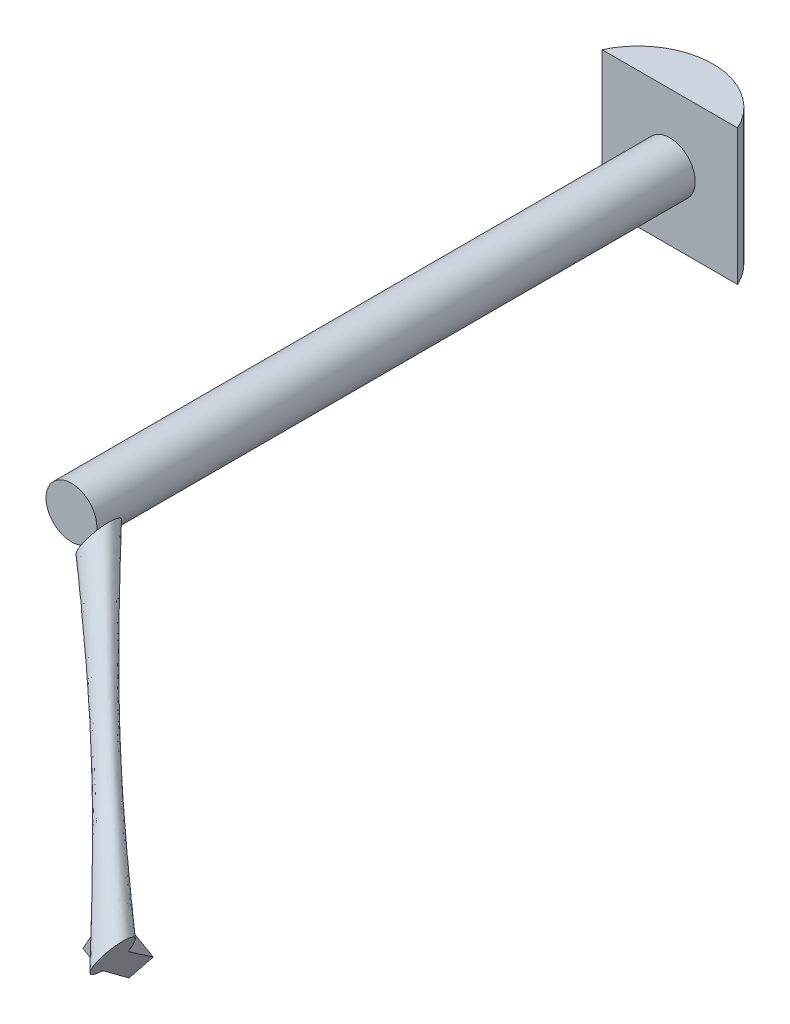
ISO-10303-21;
HEADER;
FILE_DESCRIPTION(('STEP AP214'),'2;1');
FILE_NAME('part.step','',(''),(''),'','','');
FILE_SCHEMA(('AUTOMOTIVE_DESIGN { 1 0 10303 214 1 1 1 1 }'));
ENDSEC;
DATA;
#1=APPLICATION_CONTEXT('core data for automotive mechanical design processes');
#2=APPLICATION_PROTOCOL_DEFINITION('international standard','automotive_design',2000,#1);
#3=PRODUCT_CONTEXT('',#1,'mechanical');
#4=PRODUCT('Part','Part','',(#3));
#5=PRODUCT_RELATED_PRODUCT_CATEGORY('part','',(#4));
#6=PRODUCT_DEFINITION_FORMATION('','',#4);
#7=PRODUCT_DEFINITION_CONTEXT('part definition',#1,'design');
#8=PRODUCT_DEFINITION('design','',#6,#7);
#9=PRODUCT_DEFINITION_SHAPE('','',#8);
#10=(LENGTH_UNIT() NAMED_UNIT(*) SI_UNIT(.MILLI.,.METRE.));
#11=(NAMED_UNIT(*) PLANE_ANGLE_UNIT() SI_UNIT($,.RADIAN.));
#12=(NAMED_UNIT(*) SI_UNIT($,.STERADIAN.) SOLID_ANGLE_UNIT());
#13=UNCERTAINTY_MEASURE_WITH_UNIT(LENGTH_MEASURE(1.E-05),#10,'distance_accuracy_value','');
#14=(GEOMETRIC_REPRESENTATION_CONTEXT(3) GLOBAL_UNCERTAINTY_ASSIGNED_CONTEXT((#13)) GLOBAL_UNIT_ASSIGNED_CONTEXT((#10,
#11,#12)) REPRESENTATION_CONTEXT('',''));
#15=CARTESIAN_POINT('',(0.,0.,0.));
#16=DIRECTION('',(0.,0.,1.));
#17=DIRECTION('',(1.,0.,0.));
#18=AXIS2_PLACEMENT_3D('',#15,#16,#17);
#19=CARTESIAN_POINT('',(2.07000754518601,-1.17703879518601,58.113090603571));
#20=DIRECTION('',(0.869294507164732,-0.494294507164732,0.));
#21=DIRECTION('',(0.494294507164732,0.869294507164732,0.));
#22=AXIS2_PLACEMENT_3D('',#19,#20,#21);
#23=PLANE('',#22);
#24=CARTESIAN_POINT('',(2.07000754518601,-1.17703879518601,58.113090603571));
#25=DIRECTION('',(0.869294507164732,-0.494294507164732,0.));
#26=DIRECTION('',(0.494294507164732,0.869294507164732,0.));
#27=AXIS2_PLACEMENT_3D('',#24,#25,#26);
#28=CIRCLE('',#27,1.91255995605533);
#29=CARTESIAN_POINT('',(3.01537542608738,0.485539069236103,58.113090603571));
#30=VERTEX_POINT('',#29);
#31=EDGE_CURVE('E207',#30,#30,#28,.T.);
#32=ORIENTED_EDGE('',*,*,#31,.F.);
#33=EDGE_LOOP('',(#32));
#34=FACE_BOUND('',#33,.T.);
#35=ADVANCED_FACE('F61',(#34),#23,.F.);
#36=CARTESIAN_POINT('',(24.1500880271702,-13.7321192771702,78.8962421260388));
#37=DIRECTION('',(0.869294507164732,-0.494294507164732,0.));
#38=DIRECTION('',(0.494294507164732,0.869294507164732,0.));
#39=AXIS2_PLACEMENT_3D('',#36,#37,#38);
#40=PLANE('',#39);
#41=CARTESIAN_POINT('',(24.1500880271702,-13.7321192771702,78.8962421260388));
#42=DIRECTION('',(0.869294507164732,-0.494294507164732,0.));
#43=DIRECTION('',(0.494294507164732,0.869294507164732,0.));
#44=AXIS2_PLACEMENT_3D('',#41,#42,#43);
#45=CIRCLE('',#44,1.91255995605533);
#46=CARTESIAN_POINT('',(24.1500880330426,-13.7321192668427,76.9836658218787));
#47=VERTEX_POINT('',#46);
#48=CARTESIAN_POINT('',(23.2047298948419,-15.3946799971958,78.8962421260388));
#49=VERTEX_POINT('',#48);
#50=EDGE_CURVE('E65',#47,#49,#45,.T.);
#51=ORIENTED_EDGE('',*,*,#50,.T.);
#52=DIRECTION('',(-0.494294507164733,-0.869294507164732,0.));
#53=VECTOR('',#52,1.);
#54=CARTESIAN_POINT('',(24.1500880271702,-13.7321192771702,78.8962421260388));
#55=LINE('',#54,#53);
#56=CARTESIAN_POINT('',(23.1365145695324,-15.5146473582256,78.8962421260388));
#57=VERTEX_POINT('',#56);
#58=EDGE_CURVE('E167',#49,#57,#55,.T.);
#59=ORIENTED_EDGE('',*,*,#58,.T.);
#60=DIRECTION('',(0.,0.,-1.));
#61=VECTOR('',#60,1.);
#62=CARTESIAN_POINT('',(23.1365145695324,-15.5146473582256,78.8962421260388));
#63=LINE('',#62,#61);
#64=CARTESIAN_POINT('',(23.1365145695324,-15.5146473582256,78.7582564196475));
#65=VERTEX_POINT('',#64);
#66=EDGE_CURVE('E146',#57,#65,#63,.T.);
#67=ORIENTED_EDGE('',*,*,#66,.T.);
#68=DIRECTION('',(-0.349518997919441,-0.614684040864393,-0.707106781186555));
#69=VECTOR('',#68,1.);
#70=CARTESIAN_POINT('',(23.1365145695324,-15.5146473582256,78.7582564196475));
#71=LINE('',#70,#69);
#72=CARTESIAN_POINT('',(20.7757222041953,-19.6664714347574,73.9821718564615));
#73=VERTEX_POINT('',#72);
#74=EDGE_CURVE('E190',#65,#73,#71,.T.);
#75=ORIENTED_EDGE('',*,*,#74,.T.);
#76=DIRECTION('',(0.349518997919449,0.614684040864407,-0.707106781186539));
#77=VECTOR('',#76,1.);
#78=CARTESIAN_POINT('',(20.7757222041953,-19.6664714347574,73.9821718564615));
#79=LINE('',#78,#77);
#80=CARTESIAN_POINT('',(21.525953731781,-18.3470714888165,72.4643894075142));
#81=VERTEX_POINT('',#80);
#82=EDGE_CURVE('E194',#73,#81,#79,.T.);
#83=ORIENTED_EDGE('',*,*,#82,.T.);
#84=DIRECTION('',(0.342492527068316,0.602326888545076,0.721041738207967));
#85=VECTOR('',#84,1.);
#86=CARTESIAN_POINT('',(21.525953731781,-18.3470714888165,72.4643894075142));
#87=LINE('',#86,#85);
#88=CARTESIAN_POINT('',(23.6433012983513,-14.6233833176979,76.921993148123));
#89=VERTEX_POINT('',#88);
#90=EDGE_CURVE('E361',#81,#89,#87,.T.);
#91=ORIENTED_EDGE('',*,*,#90,.T.);
#92=DIRECTION('',(0.494294507164732,0.869294507164732,0.));
#93=VECTOR('',#92,1.);
#94=CARTESIAN_POINT('',(24.1500880271702,-13.7321192771702,76.921993148123));
#95=LINE('',#94,#93);
#96=CARTESIAN_POINT('',(24.1500880271702,-13.7321192771702,76.921993148123));
#97=VERTEX_POINT('',#96);
#98=EDGE_CURVE('E172',#89,#97,#95,.T.);
#99=ORIENTED_EDGE('',*,*,#98,.T.);
#100=DIRECTION('',(0.,0.,1.));
#101=VECTOR('',#100,1.);
#102=CARTESIAN_POINT('',(24.1500880271702,-13.7321192771702,78.8962421260388));
#103=LINE('',#102,#101);
#104=EDGE_CURVE('E79',#97,#47,#103,.T.);
#105=ORIENTED_EDGE('',*,*,#104,.T.);
#106=EDGE_LOOP('',(#51,#59,#67,#75,#83,#91,#99,#105));
#107=FACE_BOUND('',#106,.T.);
#108=ADVANCED_FACE('F195',(#107),#40,.T.);
#109=CARTESIAN_POINT('',(24.6354035271289,-12.8786157641008,80.5375483753977));
#110=CARTESIAN_POINT('',(2.76762976281954,0.049839418256882,56.8223626398429));
#111=CARTESIAN_POINT('',(24.703010915765,-12.7597175551723,80.4557288169286));
#112=CARTESIAN_POINT('',(2.71446311759331,-0.0436624758358452,56.7047501963297));
#113=CARTESIAN_POINT('',(24.7745705300573,-12.6338687368314,80.3465426290617));
#114=CARTESIAN_POINT('',(2.64725177004139,-0.16186418432976,56.5847863769267));
#115=CARTESIAN_POINT('',(24.9117329358385,-12.3926471084159,80.0474221888731));
#116=CARTESIAN_POINT('',(2.47491812226677,-0.464939964535035,56.3728415194487));
#117=CARTESIAN_POINT('',(24.9774014078596,-12.277158788812,79.8562198393379));
#118=CARTESIAN_POINT('',(2.36916855696426,-0.650917180385211,56.2809843298922));
#119=CARTESIAN_POINT('',(25.0728258427746,-12.109339936046,79.3841527697597));
#120=CARTESIAN_POINT('',(2.12144239036376,-1.08658254341346,56.1864129486949));
#121=CARTESIAN_POINT('',(25.1015989120434,-12.0587379756619,79.101944056627));
#122=CARTESIAN_POINT('',(1.97901182577136,-1.33706905632808,56.1859161633387));
#123=CARTESIAN_POINT('',(25.0870305486697,-12.0843587302436,78.5026495449146));
#124=CARTESIAN_POINT('',(1.69170698228862,-1.84233973747309,56.3348458035445));
#125=CARTESIAN_POINT('',(25.0422626074632,-12.1630901845159,78.1879584659701));
#126=CARTESIAN_POINT('',(1.54827817207689,-2.09458182205826,56.4866199541246));
#127=CARTESIAN_POINT('',(24.8804907741436,-12.447591355539,77.6408563828505));
#128=CARTESIAN_POINT('',(1.31573743286572,-2.50354122653922,56.9168626087006));
#129=CARTESIAN_POINT('',(24.7646064102888,-12.6513922060544,77.412231552261));
#130=CARTESIAN_POINT('',(1.22823478233832,-2.65742837754588,57.1923536548794));
#131=CARTESIAN_POINT('',(24.5104879916785,-13.0982993479817,77.1028444034286));
#132=CARTESIAN_POINT('',(1.12931279252914,-2.83139822979486,57.758013890786));
#133=CARTESIAN_POINT('',(24.3739715228341,-13.3383849948659,77.020671770683));
#134=CARTESIAN_POINT('',(1.11686639697148,-2.85328717077123,58.0450612164633));
#135=CARTESIAN_POINT('',(24.1232461279323,-13.7793249718142,76.9675208404663));
#136=CARTESIAN_POINT('',(1.14135345392925,-2.81022283604471,58.5526655460536));
#137=CARTESIAN_POINT('',(24.0089166884487,-13.9803912436618,76.9941548833991));
#138=CARTESIAN_POINT('',(1.17715476487704,-2.74726060906241,58.7739397261066));
#139=CARTESIAN_POINT('',(23.8137752576057,-14.323578091772,77.0971939369976));
#140=CARTESIAN_POINT('',(1.26614581171837,-2.59075587942311,59.1400835509846));
#141=CARTESIAN_POINT('',(23.7323799158476,-14.466724581311,77.173116318211));
#142=CARTESIAN_POINT('',(1.31921868232626,-2.49741890272164,59.2862061237858));
#143=CARTESIAN_POINT('',(23.5971651385754,-14.7045209991682,77.336755435149));
#144=CARTESIAN_POINT('',(1.42555197277871,-2.31041511453618,59.5214310108122));
#145=CARTESIAN_POINT('',(23.5256055242832,-14.8303698175091,77.445941623016));
#146=CARTESIAN_POINT('',(1.49276332033064,-2.19221340604227,59.6413948302153));
#147=CARTESIAN_POINT('',(23.3884431185019,-15.0715914459246,77.7450620632046));
#148=CARTESIAN_POINT('',(1.66509696810525,-1.88913762583699,59.8533396876933));
#149=CARTESIAN_POINT('',(23.3227746464808,-15.1870797655284,77.9362644127398));
#150=CARTESIAN_POINT('',(1.77084653340776,-1.70316040998682,59.9451968772498));
#151=CARTESIAN_POINT('',(23.2273502115658,-15.3548986182944,78.408331482318));
#152=CARTESIAN_POINT('',(2.01857270000826,-1.26749504695857,60.039768258447));
#153=CARTESIAN_POINT('',(23.198577142297,-15.4055005786786,78.6905401954507));
#154=CARTESIAN_POINT('',(2.16100326460066,-1.01700853404395,60.0402650438033));
#155=CARTESIAN_POINT('',(23.2131455056707,-15.3798798240968,79.289834707163));
#156=CARTESIAN_POINT('',(2.4483081080834,-0.511737852898935,59.8913354035974));
#157=CARTESIAN_POINT('',(23.2579134468772,-15.3011483698246,79.6045257861076));
#158=CARTESIAN_POINT('',(2.59173691829513,-0.259495768313768,59.7395612530173));
#159=CARTESIAN_POINT('',(23.4196852801968,-15.0166471988014,80.1516278692272));
#160=CARTESIAN_POINT('',(2.8242776575063,0.149463636167197,59.3093185984413));
#161=CARTESIAN_POINT('',(23.5355696440516,-14.812846348286,80.3802526998167));
#162=CARTESIAN_POINT('',(2.9117803080337,0.303350787173855,59.0338275522625));
#163=CARTESIAN_POINT('',(23.7896880626619,-14.3659392063588,80.6896398486491));
#164=CARTESIAN_POINT('',(3.01070229784288,0.477320639422835,58.4681673163559));
#165=CARTESIAN_POINT('',(23.9262045315063,-14.1258535594745,80.7718124813947));
#166=CARTESIAN_POINT('',(3.02314869340054,0.499209580399199,58.1811199906787));
#167=CARTESIAN_POINT('',(24.1769299264081,-13.6849135825263,80.8249634116114));
#168=CARTESIAN_POINT('',(2.99866163644277,0.456145245672681,57.6735156610884));
#169=CARTESIAN_POINT('',(24.2912593658918,-13.4838473106787,80.7983293686786));
#170=CARTESIAN_POINT('',(2.96286032549498,0.393183018690379,57.4522414810354));
#171=CARTESIAN_POINT('',(24.4864007967347,-13.1406604625685,80.6952903150801));
#172=CARTESIAN_POINT('',(2.87386927865365,0.236678289051081,57.0860976561573));
#173=CARTESIAN_POINT('',(24.5677961384928,-12.9975139730294,80.6193679338667));
#174=CARTESIAN_POINT('',(2.82079640804576,0.143341312349609,56.9399750833561));
#175=CARTESIAN_POINT('',(24.6354035271289,-12.8786157641008,80.5375483753977));
#176=CARTESIAN_POINT('',(2.76762976281954,0.049839418256882,56.8223626398429));
#177=B_SPLINE_SURFACE_WITH_KNOTS('',3,1,((#109,#110),(#111,#112),(#113,#114),(#115,#116),(#117,
#118),(#119,#120),(#121,#122),(#123,#124),(#125,#126),(#127,#128),(#129,#130),(#131,#132),(#133,
#134),(#135,#136),(#137,#138),(#139,#140),(#141,#142),(#143,#144),(#145,#146),(#147,#148),(#149,
#150),(#151,#152),(#153,#154),(#155,#156),(#157,#158),(#159,#160),(#161,#162),(#163,#164),(#165,
#166),(#167,#168),(#169,#170),(#171,#172),(#173,#174),(#175,#176)),.UNSPECIFIED.,.T.,.F.,.F.,(4,
2,2,2,2,2,2,2,2,2,2,2,2,2,2,2,4),(2,2),(0.,0.0625,0.125,0.1875,0.25,0.3125,0.375,0.4375,0.5,
0.5625,0.625,0.6875,0.75,0.8125,0.875,0.9375,1.),(0.,1.),.UNSPECIFIED.);
#178=CARTESIAN_POINT('',(23.2047396434156,-15.3946628527982,78.8962421252233));
#179=CARTESIAN_POINT('',(23.1777246445922,-15.3759183895869,78.8962421257382));
#180=CARTESIAN_POINT('',(23.1510298617448,-15.356715059265,78.8962421259565));
#181=CARTESIAN_POINT('',(23.098324903817,-15.3173920859392,78.8962421261212));
#182=CARTESIAN_POINT('',(23.0723147159399,-15.297272460082,78.8962421260676));
#183=CARTESIAN_POINT('',(22.9953832773278,-15.2355461878209,78.8962421259814));
#184=CARTESIAN_POINT('',(22.9455532571125,-15.1925666860731,78.8962421260234));
#185=CARTESIAN_POINT('',(22.8487314830775,-15.103001950689,78.8962421260544));
#186=CARTESIAN_POINT('',(22.8017573840126,-15.0563976911388,78.8962421260431));
#187=CARTESIAN_POINT('',(22.7112104138071,-14.9599816153487,78.8962421260346));
#188=CARTESIAN_POINT('',(22.667637825548,-14.9101695329624,78.8962421260374));
#189=CARTESIAN_POINT('',(22.5841480464932,-14.8073842601202,78.8962421260397));
#190=CARTESIAN_POINT('',(22.5442390380799,-14.7544044101678,78.8962421260391));
#191=CARTESIAN_POINT('',(22.4686173921517,-14.6455272279079,78.8962421260386));
#192=CARTESIAN_POINT('',(22.4329044036354,-14.5896301401961,78.8962421260388));
#193=CARTESIAN_POINT('',(22.3663343538047,-14.4751321826073,78.8962421260389));
#194=CARTESIAN_POINT('',(22.335468456702,-14.4165364903566,78.8962421260389));
#195=CARTESIAN_POINT('',(22.2790699651719,-14.2968627722957,78.8962421260388));
#196=CARTESIAN_POINT('',(22.2535365730636,-14.2357851193933,78.8962421260388));
#197=CARTESIAN_POINT('',(22.1933292230918,-14.0712802422269,78.8962421260389));
#198=CARTESIAN_POINT('',(22.1634303479442,-13.9660213002531,78.8962421260388));
#199=CARTESIAN_POINT('',(22.1315083163621,-13.8056352741828,78.8962421260388));
#200=CARTESIAN_POINT('',(22.123020905729,-13.7517264338986,78.8962421260388));
#201=CARTESIAN_POINT('',(22.1106826798168,-13.6433830674256,78.8962421260388));
#202=CARTESIAN_POINT('',(22.106830861922,-13.5889486574788,78.8962421260388));
#203=CARTESIAN_POINT('',(22.1029876103557,-13.4243685946534,78.8962421260388));
#204=CARTESIAN_POINT('',(22.1109187152446,-13.3139249909614,78.8962421260388));
#205=CARTESIAN_POINT('',(22.1484300803629,-13.0969695239454,78.8962421260388));
#206=CARTESIAN_POINT('',(22.1779519568977,-12.9904478695635,78.8962421260388));
#207=CARTESIAN_POINT('',(22.2299312751022,-12.8578592621307,78.8962421260388));
#208=CARTESIAN_POINT('',(22.2427820739828,-12.8278423409597,78.8962421260388));
#209=CARTESIAN_POINT('',(22.2703319384579,-12.768719604788,78.8962421260388));
#210=CARTESIAN_POINT('',(22.2850284474355,-12.7396125977469,78.8962421260389));
#211=CARTESIAN_POINT('',(22.3006567788507,-12.7109912314938,78.8962421260389));
#212=B_SPLINE_CURVE_WITH_KNOTS('',3,(#178,#179,#180,#181,#182,#183,#184,#185,#186,#187,#188,
#189,#190,#191,#192,#193,#194,#195,#196,#197,#198,#199,#200,#201,#202,#203,#204,#205,#206,#207,
#208,#209,#210,#211),.UNSPECIFIED.,.F.,.F.,(4,2,2,2,2,2,2,2,2,2,2,2,2,2,2,2,4),(0.,
0.0986349603167085,0.197268075606738,0.394505575221934,0.592859081541641,0.791229066089654,
0.990031834653407,1.18881796130067,1.38723740452297,1.58562714520439,1.91237937298792,
2.07593683218802,2.23945890977244,2.56945954206154,2.89857110230715,2.99648009207666,
3.09425492719558),.UNSPECIFIED.);
#213=CARTESIAN_POINT('',(22.1383472582196,-13.1591717820901,78.8962421260388));
#214=VERTEX_POINT('',#213);
#215=EDGE_CURVE('E13',#49,#214,#212,.T.);
#216=CARTESIAN_POINT('',(24.0764611652808,-13.6902538873492,76.921993148123));
#217=CARTESIAN_POINT('',(24.1010034525773,-13.7042090172896,76.9425452566736));
#218=CARTESIAN_POINT('',(24.1255457398738,-13.7181641472299,76.9630973652241));
#219=CARTESIAN_POINT('',(24.1500880271702,-13.7321192771702,76.9836494737746));
#220=B_SPLINE_CURVE_WITH_KNOTS('',3,(#216,#217,#218,#219),.UNSPECIFIED.,.F.,.F.,(4,4),(0.,
0.104762245820675),.UNSPECIFIED.);
#221=CARTESIAN_POINT('',(24.0764611652808,-13.6902538873492,76.921993148123));
#222=VERTEX_POINT('',#221);
#223=EDGE_CURVE('E71',#222,#47,#220,.T.);
#224=CARTESIAN_POINT('',(21.8632557007883,-14.3429225602453,76.921993148123));
#225=CARTESIAN_POINT('',(21.9259712366764,-14.3635146357415,76.921993148123));
#226=CARTESIAN_POINT('',(21.9895037727592,-14.3816582352534,76.921993148123));
#227=CARTESIAN_POINT('',(22.11788031368,-14.4127885146216,76.921993148123));
#228=CARTESIAN_POINT('',(22.1827254865935,-14.4257703682376,76.9219931481231));
#229=CARTESIAN_POINT('',(22.3137326098389,-14.4463478379497,76.921993148123));
#230=CARTESIAN_POINT('',(22.3799005314803,-14.4539060258814,76.9219931481229));
#231=CARTESIAN_POINT('',(22.512606148122,-14.4631788924248,76.9219931481232));
#232=CARTESIAN_POINT('',(22.5791436856377,-14.4648958932551,76.9219931481235));
#233=CARTESIAN_POINT('',(22.7521895413757,-14.4614271491597,76.9219931481238));
#234=CARTESIAN_POINT('',(22.8586638302425,-14.451467511406,76.9219931481232));
#235=CARTESIAN_POINT('',(23.0682459729226,-14.4141258865917,76.9219931481228));
#236=CARTESIAN_POINT('',(23.1713631433755,-14.3867973846026,76.921993148123));
#237=CARTESIAN_POINT('',(23.3547826848554,-14.3201543544552,76.9219931481231));
#238=CARTESIAN_POINT('',(23.4360520816107,-14.283542771549,76.921993148123));
#239=CARTESIAN_POINT('',(23.552482963405,-14.2188027169391,76.921993148123));
#240=CARTESIAN_POINT('',(23.5904032465766,-14.1955678212958,76.921993148123));
#241=CARTESIAN_POINT('',(23.6640798981796,-14.1458993457515,76.921993148123));
#242=CARTESIAN_POINT('',(23.6998369918802,-14.1194668469515,76.9219931481231));
#243=CARTESIAN_POINT('',(23.769109867379,-14.0633578078904,76.9219931481231));
#244=CARTESIAN_POINT('',(23.802609018164,-14.0336607094538,76.921993148123));
#245=CARTESIAN_POINT('',(23.8666914342765,-13.9712978834843,76.921993148123));
#246=CARTESIAN_POINT('',(23.8972762878269,-13.938633792072,76.921993148123));
#247=CARTESIAN_POINT('',(23.9551795067152,-13.8705917246631,76.921993148123));
#248=CARTESIAN_POINT('',(23.9825015816035,-13.835216907193,76.921993148123));
#249=CARTESIAN_POINT('',(24.0335972727233,-13.7620138756306,76.921993148123));
#250=CARTESIAN_POINT('',(24.0573728684256,-13.7241870471732,76.921993148123));
#251=CARTESIAN_POINT('',(24.0954491141997,-13.6565465600861,76.921993148123));
#252=CARTESIAN_POINT('',(24.1106050816769,-13.6272103511224,76.921993148123));
#253=CARTESIAN_POINT('',(24.1387746346434,-13.5675868091326,76.921993148123));
#254=CARTESIAN_POINT('',(24.1517917741395,-13.5373011555797,76.921993148123));
#255=CARTESIAN_POINT('',(24.1637271861744,-13.5065923868722,76.921993148123));
#256=B_SPLINE_CURVE_WITH_KNOTS('',3,(#224,#225,#226,#227,#228,#229,#230,#231,#232,#233,#234,
#235,#236,#237,#238,#239,#240,#241,#242,#243,#244,#245,#246,#247,#248,#249,#250,#251,#252,#253,
#254,#255),.UNSPECIFIED.,.F.,.F.,(4,2,2,2,2,2,2,2,2,2,2,2,2,2,2,4),(0.,0.197995946131643,
0.396176585879469,0.59571203090335,0.795168139467853,1.114612142391,1.43307719547207,
1.69928039598758,1.83255025083357,1.96577517277323,2.09989314669422,2.23393760637385,
2.3678281859579,2.5016437524836,2.60062392177523,2.69943791884672),.UNSPECIFIED.);
#257=CARTESIAN_POINT('',(23.2038282454501,-14.3734920388441,76.921993148123));
#258=VERTEX_POINT('',#257);
#259=EDGE_CURVE('E87',#258,#222,#256,.T.);
#260=CARTESIAN_POINT('',(20.1665144085951,-13.1523812025018,76.4643018722201));
#261=CARTESIAN_POINT('',(20.1728021989966,-13.1683155449511,76.4531217752301));
#262=CARTESIAN_POINT('',(20.1800194654192,-13.1842240449282,76.442443155986));
#263=CARTESIAN_POINT('',(20.1961566660329,-13.2158227631027,76.4221591894628));
#264=CARTESIAN_POINT('',(20.2050740499025,-13.2315132709563,76.4125522683328));
#265=CARTESIAN_POINT('',(20.2243190763498,-13.2623085397592,76.3945937028901));
#266=CARTESIAN_POINT('',(20.2346217847247,-13.277418660149,76.3862243848062));
#267=CARTESIAN_POINT('',(20.2565763602326,-13.307215421597,76.3705628080097));
#268=CARTESIAN_POINT('',(20.2682286964793,-13.3219019131784,76.3632709258165));
#269=CARTESIAN_POINT('',(20.2959950463872,-13.3546344492462,76.3479430525113));
#270=CARTESIAN_POINT('',(20.3124682853132,-13.3725270570763,76.3402306388677));
#271=CARTESIAN_POINT('',(20.3468858774864,-13.4074612046606,76.3263324036166));
#272=CARTESIAN_POINT('',(20.3648308384926,-13.4245023880903,76.3201472169611));
#273=CARTESIAN_POINT('',(20.4206423060141,-13.4745576403413,76.303574759553));
#274=CARTESIAN_POINT('',(20.460291211289,-13.5062836647014,76.2952694919369));
#275=CARTESIAN_POINT('',(20.5382614222289,-13.5634914672026,76.2836246869531));
#276=CARTESIAN_POINT('',(20.5763079611278,-13.5892801556618,76.2798661815454));
#277=CARTESIAN_POINT('',(20.6540046779722,-13.6386559692176,76.2751656036753));
#278=CARTESIAN_POINT('',(20.6936562212105,-13.6622411610065,76.274225982379));
#279=CARTESIAN_POINT('',(20.7740394012152,-13.7074613777012,76.2746664572678));
#280=CARTESIAN_POINT('',(20.814771348181,-13.7290958345048,76.2760472269236));
#281=CARTESIAN_POINT('',(20.8970002205992,-13.7706500636884,76.280753375934));
#282=CARTESIAN_POINT('',(20.9384974120141,-13.7905692257374,76.2840794442056));
#283=CARTESIAN_POINT('',(21.026593494031,-13.8309477379458,76.2928671131521));
#284=CARTESIAN_POINT('',(21.0732544205801,-13.8512283261378,76.2985223337441));
#285=CARTESIAN_POINT('',(21.167008265145,-13.8901464840301,76.3115412742113));
#286=CARTESIAN_POINT('',(21.2141011602257,-13.9087841404094,76.3189049038785));
#287=CARTESIAN_POINT('',(21.3559241692114,-13.9625564721517,76.3432122249146));
#288=CARTESIAN_POINT('',(21.4511076683299,-13.9955099261525,76.3623622844181));
#289=CARTESIAN_POINT('',(21.6423607504127,-14.0568146791476,76.4052813454557));
#290=CARTESIAN_POINT('',(21.7384323943786,-14.0851443902748,76.4290709357495));
#291=CARTESIAN_POINT('',(21.9306322623017,-14.1377639613748,76.4803337148815));
#292=CARTESIAN_POINT('',(22.0267604338887,-14.1620558358252,76.5078050544626));
#293=CARTESIAN_POINT('',(22.2102374745906,-14.2051184608892,76.5632263404964));
#294=CARTESIAN_POINT('',(22.2975974304112,-14.2241894039395,76.5909104322062));
#295=CARTESIAN_POINT('',(22.4721286266172,-14.2597248100224,76.648539396262));
#296=CARTESIAN_POINT('',(22.5592998027484,-14.2761884918138,76.6784849422769));
#297=CARTESIAN_POINT('',(22.7333650276169,-14.3066816047682,76.7404355372772));
#298=CARTESIAN_POINT('',(22.820258977874,-14.3207102488762,76.7724412475854));
#299=CARTESIAN_POINT('',(22.9920323719017,-14.3462459257699,76.8376975321741));
#300=CARTESIAN_POINT('',(23.0769188238445,-14.3577956474969,76.8709130943913));
#301=CARTESIAN_POINT('',(23.2462521186685,-14.3788516048447,76.938966655076));
#302=CARTESIAN_POINT('',(23.3306991235451,-14.3883586545542,76.9738040004361));
#303=CARTESIAN_POINT('',(23.4990490860707,-14.4053912882901,77.044991302521));
#304=CARTESIAN_POINT('',(23.5829525226767,-14.4129189467102,77.0813396290899));
#305=CARTESIAN_POINT('',(23.6666038223821,-14.4194949035138,77.1184191825045));
#306=B_SPLINE_CURVE_WITH_KNOTS('',3,(#260,#261,#262,#263,#264,#265,#266,#267,#268,#269,#270,
#271,#272,#273,#274,#275,#276,#277,#278,#279,#280,#281,#282,#283,#284,#285,#286,#287,#288,#289,
#290,#291,#292,#293,#294,#295,#296,#297,#298,#299,#300,#301,#302,#303,#304,#305),.UNSPECIFIED.,
.F.,.F.,(4,2,2,2,2,2,2,2,2,2,2,2,2,2,2,2,2,2,2,2,2,2,4),(0.,0.0613278972584382,
0.122564511158551,0.1828181904155,0.243092876304295,0.319507198984364,0.395953237994167,
0.549762580614272,0.687936378210513,0.826230290332083,0.964564347846059,1.102947425313,
1.25644998343194,1.40994443811031,1.71723262797151,2.02591683783762,2.33444657982703,
2.61519372842022,2.89602484172987,3.17694655717092,3.45255297434897,3.72804934646493,
4.00325583835876),.UNSPECIFIED.);
#307=CARTESIAN_POINT('',(21.6304558701665,-14.0523785393396,76.4031707406293));
#308=VERTEX_POINT('',#307);
#309=EDGE_CURVE('E205',#308,#258,#306,.T.);
#310=CARTESIAN_POINT('',(22.3836815886115,-12.7277128386115,75.498197224959));
#311=CARTESIAN_POINT('',(22.3595835614752,-12.7700930033097,75.498180211353));
#312=CARTESIAN_POINT('',(22.3354866670133,-12.8124711760222,75.5002297806026));
#313=CARTESIAN_POINT('',(22.2874676536675,-12.8969201511492,75.5084278383239));
#314=CARTESIAN_POINT('',(22.2635455077113,-12.9389910011747,75.5145756776591));
#315=CARTESIAN_POINT('',(22.2160570729669,-13.0225068705173,75.5309304278787));
#316=CARTESIAN_POINT('',(22.1924905510984,-13.0639522997429,75.5411345485769));
#317=CARTESIAN_POINT('',(22.1458734685714,-13.1459357593876,75.565508492445));
#318=CARTESIAN_POINT('',(22.1228229309548,-13.186473749284,75.5796784923361));
#319=CARTESIAN_POINT('',(22.0545986928303,-13.3064567848984,75.6280068638688));
#320=CARTESIAN_POINT('',(22.0103728899999,-13.3842348037073,75.6679764546303));
#321=CARTESIAN_POINT('',(21.9471183044655,-13.4954779248851,75.738851262687));
#322=CARTESIAN_POINT('',(21.9265409761134,-13.5316663879357,75.7643068073148));
#323=CARTESIAN_POINT('',(21.8864934489077,-13.6020962529671,75.8185916784149));
#324=CARTESIAN_POINT('',(21.8670233112148,-13.6363375473874,75.8474211909949));
#325=CARTESIAN_POINT('',(21.8292927966915,-13.7026925817894,75.9083504038691));
#326=CARTESIAN_POINT('',(21.8110357343728,-13.7348004926817,75.9404585009912));
#327=CARTESIAN_POINT('',(21.7759535235667,-13.7964980691486,76.0077298412041));
#328=CARTESIAN_POINT('',(21.7591283120981,-13.8260878454855,76.0428929497799));
#329=CARTESIAN_POINT('',(21.7270004890357,-13.882589667194,76.1159603086413));
#330=CARTESIAN_POINT('',(21.7116979865323,-13.909501520713,76.1538647549873));
#331=CARTESIAN_POINT('',(21.6827162299704,-13.9604704904709,76.232136585921));
#332=CARTESIAN_POINT('',(21.669037029674,-13.9845275121609,76.2725040520142));
#333=CARTESIAN_POINT('',(21.643461401506,-14.0295062702929,76.3552722013031));
#334=CARTESIAN_POINT('',(21.631558302205,-14.0504397394911,76.3976644435695));
#335=CARTESIAN_POINT('',(21.6095641139476,-14.0891199731668,76.484330968728));
#336=CARTESIAN_POINT('',(21.5994730408776,-14.1068667097054,76.5286052681164));
#337=CARTESIAN_POINT('',(21.5811629720784,-14.1390678408169,76.618714195215));
#338=CARTESIAN_POINT('',(21.5729440763765,-14.1535220594763,76.664548906145));
#339=CARTESIAN_POINT('',(21.5584642071886,-14.1789871831364,76.7574666150492));
#340=CARTESIAN_POINT('',(21.5522031701253,-14.189998199948,76.8045495724353));
#341=CARTESIAN_POINT('',(21.5416865107029,-14.2084933969149,76.8994624068216));
#342=CARTESIAN_POINT('',(21.53742453602,-14.2159887486289,76.9472894120245));
#343=CARTESIAN_POINT('',(21.5308628755647,-14.2275284588805,77.0434958146896));
#344=CARTESIAN_POINT('',(21.5285633990977,-14.2315724493218,77.0918752705147));
#345=CARTESIAN_POINT('',(21.525954400078,-14.2361607837745,77.1888493390843));
#346=CARTESIAN_POINT('',(21.5256447265104,-14.2367053933694,77.2374439352209));
#347=CARTESIAN_POINT('',(21.5270421406085,-14.2342478212498,77.3345143415019));
#348=CARTESIAN_POINT('',(21.5287489057248,-14.231246206789,77.3829901694017));
#349=CARTESIAN_POINT('',(21.5328476002517,-14.2240380088681,77.4555905507487));
#350=CARTESIAN_POINT('',(21.5344828652021,-14.2211621386763,77.4798980808163));
#351=CARTESIAN_POINT('',(21.5382875433065,-14.2144710148023,77.5283414467516));
#352=CARTESIAN_POINT('',(21.5404569528663,-14.2106557674412,77.5524772837736));
#353=CARTESIAN_POINT('',(21.5477325673272,-14.1978604569624,77.6245694591432));
#354=CARTESIAN_POINT('',(21.553606478655,-14.1875302615449,77.6722160545329));
#355=CARTESIAN_POINT('',(21.5672908869751,-14.1634640807275,77.7663502950371));
#356=CARTESIAN_POINT('',(21.5751013330317,-14.149728184906,77.8128379705987));
#357=CARTESIAN_POINT('',(21.5925817657027,-14.118986099199,77.904346680774));
#358=CARTESIAN_POINT('',(21.6022518395276,-14.10197975594,77.9493676464879));
#359=CARTESIAN_POINT('',(21.6339646620552,-14.0462077778373,78.0816902357174));
#360=CARTESIAN_POINT('',(21.6587343728377,-14.0026463519764,78.1664188060606));
#361=CARTESIAN_POINT('',(21.7152865543186,-13.9031904607678,78.3257065692794));
#362=CARTESIAN_POINT('',(21.7470700291858,-13.8472942294317,78.4002643035085));
#363=CARTESIAN_POINT('',(21.7986295481673,-13.7566187191984,78.5026922217766));
#364=CARTESIAN_POINT('',(21.816300359178,-13.725541823287,78.5350349484702));
#365=CARTESIAN_POINT('',(21.852882193326,-13.661206923696,78.5967382410203));
#366=CARTESIAN_POINT('',(21.871793277574,-13.6279488125435,78.6260986597505));
#367=CARTESIAN_POINT('',(21.9107137760292,-13.5595010045408,78.6815862506256));
#368=CARTESIAN_POINT('',(21.9307221554475,-13.5243131275293,78.7077163958429));
#369=CARTESIAN_POINT('',(21.9717541111751,-13.4521519903626,78.7564463457952));
#370=CARTESIAN_POINT('',(21.9927772051177,-13.4151795785252,78.7790478067454));
#371=CARTESIAN_POINT('',(22.0342725082299,-13.3422035722259,78.8191305237902));
#372=CARTESIAN_POINT('',(22.0546880964811,-13.3062995545399,78.8368525922442));
#373=CARTESIAN_POINT('',(22.0961066514612,-13.2334585218822,78.8690046322379));
#374=CARTESIAN_POINT('',(22.1171086366688,-13.1965232330697,78.8834397734474));
#375=CARTESIAN_POINT('',(22.1383472582196,-13.1591717820901,78.8962421260389));
#376=B_SPLINE_CURVE_WITH_KNOTS('',3,(#310,#311,#312,#313,#314,#315,#316,#317,#318,#319,#320,
#321,#322,#323,#324,#325,#326,#327,#328,#329,#330,#331,#332,#333,#334,#335,#336,#337,#338,#339,
#340,#341,#342,#343,#344,#345,#346,#347,#348,#349,#350,#351,#352,#353,#354,#355,#356,#357,#358,
#359,#360,#361,#362,#363,#364,#365,#366,#367,#368,#369,#370,#371,#372,#373,#374,#375),
.UNSPECIFIED.,.F.,.F.,(4,2,2,2,2,2,2,2,2,2,2,2,2,2,2,2,2,2,2,2,2,2,2,2,2,2,2,2,2,2,2,2,4),(0.,
0.1462082121605,0.292393271487836,0.438477948309447,0.584569135758849,0.876876448956308,
1.02312982266271,1.16939126750106,1.31603717569367,1.46267663020139,1.6093265827451,
1.7559813908165,1.90207065848212,2.0481612068873,2.19425955883076,2.34035316604299,
2.48597933989958,2.63162104321331,2.77725169300543,2.92285905088625,2.99643320262807,
3.0700068593077,3.21713734029915,3.36426395180255,3.51139746474665,3.80514753308436,
4.09893968527816,4.24344433952762,4.38795611917078,4.53233388715816,4.67664368527494,
4.81133856082857,4.94582010242951),.UNSPECIFIED.);
#377=EDGE_CURVE('E204',#308,#214,#376,.T.);
#378=ORIENTED_EDGE('',*,*,#215,.F.);
#379=ORIENTED_EDGE('',*,*,#50,.F.);
#380=ORIENTED_EDGE('',*,*,#223,.F.);
#381=ORIENTED_EDGE('',*,*,#259,.F.);
#382=ORIENTED_EDGE('',*,*,#309,.F.);
#383=ORIENTED_EDGE('',*,*,#377,.T.);
#384=EDGE_LOOP('',(#378,#379,#380,#381,#382,#383));
#385=FACE_BOUND('',#384,.T.);
#386=ORIENTED_EDGE('',*,*,#31,.T.);
#387=EDGE_LOOP('',(#386));
#388=FACE_BOUND('',#387,.T.);
#389=ADVANCED_FACE('F199',(#385,#388),#177,.T.);
#390=CARTESIAN_POINT('',(22.3836815886115,-12.7277128386115,78.8962421260388));
#391=DIRECTION('',(0.,0.,1.));
#392=DIRECTION('',(1.,0.,0.));
#393=AXIS2_PLACEMENT_3D('',#390,#391,#392);
#394=PLANE('',#393);
#395=ORIENTED_EDGE('',*,*,#58,.F.);
#396=ORIENTED_EDGE('',*,*,#215,.T.);
#397=DIRECTION('',(-0.494294507164733,-0.869294507164732,0.));
#398=VECTOR('',#397,1.);
#399=CARTESIAN_POINT('',(22.3836815886115,-12.7277128386115,78.8962421260388));
#400=LINE('',#399,#398);
#401=CARTESIAN_POINT('',(21.3701081309736,-14.5102409196669,78.8962421260388));
#402=VERTEX_POINT('',#401);
#403=EDGE_CURVE('E131',#214,#402,#400,.T.);
#404=ORIENTED_EDGE('',*,*,#403,.T.);
#405=DIRECTION('',(0.869294507164732,-0.494294507164732,0.));
#406=VECTOR('',#405,1.);
#407=CARTESIAN_POINT('',(21.3701081309736,-14.5102409196669,78.8962421260388));
#408=LINE('',#407,#406);
#409=EDGE_CURVE('E134',#402,#57,#408,.T.);
#410=ORIENTED_EDGE('',*,*,#409,.T.);
#411=EDGE_LOOP('',(#395,#396,#404,#410));
#412=FACE_BOUND('',#411,.T.);
#413=ADVANCED_FACE('F133',(#412),#394,.T.);
#414=CARTESIAN_POINT('',(22.3836815886115,-12.7277128386115,78.8962421260388));
#415=DIRECTION('',(0.494294507164732,0.869294507164732,0.));
#416=DIRECTION('',(-0.869294507164732,0.494294507164732,0.));
#417=AXIS2_PLACEMENT_3D('',#414,#415,#416);
#418=PLANE('',#417);
#419=DIRECTION('',(0.869294507164732,-0.494294507164732,0.));
#420=VECTOR('',#419,1.);
#421=CARTESIAN_POINT('',(22.3836815886115,-12.7277128386115,76.921993148123));
#422=LINE('',#421,#420);
#423=EDGE_CURVE('E180',#222,#97,#422,.T.);
#424=ORIENTED_EDGE('',*,*,#423,.F.);
#425=ORIENTED_EDGE('',*,*,#223,.T.);
#426=ORIENTED_EDGE('',*,*,#104,.F.);
#427=EDGE_LOOP('',(#424,#425,#426));
#428=FACE_BOUND('',#427,.T.);
#429=ADVANCED_FACE('F230',(#428),#418,.T.);
#430=CARTESIAN_POINT('',(22.3836815886115,-12.7277128386115,76.921993148123));
#431=DIRECTION('',(0.,0.,-1.));
#432=DIRECTION('',(-1.,0.,0.));
#433=AXIS2_PLACEMENT_3D('',#430,#431,#432);
#434=PLANE('',#433);
#435=DIRECTION('',(0.869294507164732,-0.494294507164732,0.));
#436=VECTOR('',#435,1.);
#437=CARTESIAN_POINT('',(21.8768948597926,-13.6189768791392,76.921993148123));
#438=LINE('',#437,#436);
#439=EDGE_CURVE('E182',#258,#89,#438,.T.);
#440=ORIENTED_EDGE('',*,*,#439,.F.);
#441=ORIENTED_EDGE('',*,*,#259,.T.);
#442=ORIENTED_EDGE('',*,*,#423,.T.);
#443=ORIENTED_EDGE('',*,*,#98,.F.);
#444=EDGE_LOOP('',(#440,#441,#442,#443));
#445=FACE_BOUND('',#444,.T.);
#446=ADVANCED_FACE('F234',(#445),#434,.T.);
#447=CARTESIAN_POINT('',(19.7595472932222,-17.3426650502577,72.4643894075142));
#448=DIRECTION('',(0.356406970632709,0.626797622460696,-0.692891630604695));
#449=DIRECTION('',(0.,0.741591329011824,0.670851921614955));
#450=AXIS2_PLACEMENT_3D('',#447,#448,#449);
#451=PLANE('',#450);
#452=DIRECTION('',(0.342492527068316,0.602326888545076,0.721041738207967));
#453=VECTOR('',#452,1.);
#454=CARTESIAN_POINT('',(19.7595472932222,-17.3426650502577,72.4643894075142));
#455=LINE('',#454,#453);
#456=CARTESIAN_POINT('',(19.7595472932222,-17.3426650502577,72.4643894075142));
#457=VERTEX_POINT('',#456);
#458=EDGE_CURVE('E148',#457,#308,#455,.T.);
#459=ORIENTED_EDGE('',*,*,#458,.T.);
#460=ORIENTED_EDGE('',*,*,#309,.T.);
#461=ORIENTED_EDGE('',*,*,#439,.T.);
#462=ORIENTED_EDGE('',*,*,#90,.F.);
#463=DIRECTION('',(0.869294507164732,-0.494294507164732,0.));
#464=VECTOR('',#463,1.);
#465=CARTESIAN_POINT('',(19.7595472932222,-17.3426650502577,72.4643894075142));
#466=LINE('',#465,#464);
#467=EDGE_CURVE('E184',#457,#81,#466,.T.);
#468=ORIENTED_EDGE('',*,*,#467,.F.);
#469=EDGE_LOOP('',(#459,#460,#461,#462,#468));
#470=FACE_BOUND('',#469,.T.);
#471=ADVANCED_FACE('F317',(#470),#451,.T.);
#472=CARTESIAN_POINT('',(19.0093157656366,-18.6620649961986,73.9821718564615));
#473=DIRECTION('',(-0.349518997919441,-0.614684040864392,-0.707106781186556));
#474=DIRECTION('',(0.,0.754706676957768,-0.65606236879992));
#475=AXIS2_PLACEMENT_3D('',#472,#473,#474);
#476=PLANE('',#475);
#477=ORIENTED_EDGE('',*,*,#82,.F.);
#478=DIRECTION('',(0.869294507164732,-0.494294507164732,0.));
#479=VECTOR('',#478,1.);
#480=CARTESIAN_POINT('',(19.0093157656366,-18.6620649961986,73.9821718564615));
#481=LINE('',#480,#479);
#482=CARTESIAN_POINT('',(19.0093157656366,-18.6620649961986,73.9821718564615));
#483=VERTEX_POINT('',#482);
#484=EDGE_CURVE('E186',#483,#73,#481,.T.);
#485=ORIENTED_EDGE('',*,*,#484,.F.);
#486=DIRECTION('',(0.349518997919449,0.614684040864407,-0.707106781186539));
#487=VECTOR('',#486,1.);
#488=CARTESIAN_POINT('',(19.0093157656366,-18.6620649961986,73.9821718564615));
#489=LINE('',#488,#487);
#490=EDGE_CURVE('E156',#483,#457,#489,.T.);
#491=ORIENTED_EDGE('',*,*,#490,.T.);
#492=ORIENTED_EDGE('',*,*,#467,.T.);
#493=EDGE_LOOP('',(#477,#485,#491,#492));
#494=FACE_BOUND('',#493,.T.);
#495=ADVANCED_FACE('F325',(#494),#476,.T.);
#496=CARTESIAN_POINT('',(21.3701081309736,-14.5102409196669,78.7582564196475));
#497=DIRECTION('',(-0.349518997919449,-0.614684040864407,0.70710678118654));
#498=DIRECTION('',(0.,-0.754706676957754,-0.656062368799938));
#499=AXIS2_PLACEMENT_3D('',#496,#497,#498);
#500=PLANE('',#499);
#501=ORIENTED_EDGE('',*,*,#74,.F.);
#502=DIRECTION('',(0.869294507164732,-0.494294507164732,0.));
#503=VECTOR('',#502,1.);
#504=CARTESIAN_POINT('',(21.3701081309736,-14.5102409196669,78.7582564196475));
#505=LINE('',#504,#503);
#506=CARTESIAN_POINT('',(21.3701081309736,-14.5102409196669,78.7582564196475));
#507=VERTEX_POINT('',#506);
#508=EDGE_CURVE('E147',#507,#65,#505,.T.);
#509=ORIENTED_EDGE('',*,*,#508,.F.);
#510=DIRECTION('',(-0.349518997919441,-0.614684040864393,-0.707106781186555));
#511=VECTOR('',#510,1.);
#512=CARTESIAN_POINT('',(21.3701081309736,-14.5102409196669,78.7582564196475));
#513=LINE('',#512,#511);
#514=EDGE_CURVE('E154',#507,#483,#513,.T.);
#515=ORIENTED_EDGE('',*,*,#514,.T.);
#516=ORIENTED_EDGE('',*,*,#484,.T.);
#517=EDGE_LOOP('',(#501,#509,#515,#516));
#518=FACE_BOUND('',#517,.T.);
#519=ADVANCED_FACE('F191',(#518),#500,.T.);
#520=CARTESIAN_POINT('',(21.3701081309736,-14.5102409196669,78.8962421260388));
#521=DIRECTION('',(-0.494294507164732,-0.869294507164732,0.));
#522=DIRECTION('',(0.869294507164732,-0.494294507164732,0.));
#523=AXIS2_PLACEMENT_3D('',#520,#521,#522);
#524=PLANE('',#523);
#525=ORIENTED_EDGE('',*,*,#66,.F.);
#526=ORIENTED_EDGE('',*,*,#409,.F.);
#527=DIRECTION('',(0.,0.,-1.));
#528=VECTOR('',#527,1.);
#529=CARTESIAN_POINT('',(21.3701081309736,-14.5102409196669,78.8962421260388));
#530=LINE('',#529,#528);
#531=EDGE_CURVE('E140',#402,#507,#530,.T.);
#532=ORIENTED_EDGE('',*,*,#531,.T.);
#533=ORIENTED_EDGE('',*,*,#508,.T.);
#534=EDGE_LOOP('',(#525,#526,#532,#533));
#535=FACE_BOUND('',#534,.T.);
#536=ADVANCED_FACE('F144',(#535),#524,.T.);
#537=CARTESIAN_POINT('',(22.3836815886115,-12.7277128386115,0.));
#538=DIRECTION('',(0.869294507164732,-0.494294507164733,0.));
#539=DIRECTION('',(0.494294507164733,0.869294507164732,0.));
#540=AXIS2_PLACEMENT_3D('',#537,#538,#539);
#541=PLANE('',#540);
#542=ORIENTED_EDGE('',*,*,#377,.F.);
#543=ORIENTED_EDGE('',*,*,#458,.F.);
#544=ORIENTED_EDGE('',*,*,#490,.F.);
#545=ORIENTED_EDGE('',*,*,#514,.F.);
#546=ORIENTED_EDGE('',*,*,#531,.F.);
#547=ORIENTED_EDGE('',*,*,#403,.F.);
#548=EDGE_LOOP('',(#542,#543,#544,#545,#546,#547));
#549=FACE_BOUND('',#548,.T.);
#550=ADVANCED_FACE('F151',(#549),#541,.F.);
#551=CLOSED_SHELL('',(#35,#108,#389,#413,#429,#446,#471,#495,#519,#536,#550));
#552=MANIFOLD_SOLID_BREP('B2',#551);
#553=CARTESIAN_POINT('',(0.,6.35,5.53777131074244));
#554=DIRECTION('',(0.,-1.,0.));
#555=DIRECTION('',(0.,0.,-1.));
#556=AXIS2_PLACEMENT_3D('',#553,#554,#555);
#557=CYLINDRICAL_SURFACE('',#556,7.0119607149684);
#558=CARTESIAN_POINT('',(0.,-6.35,5.53777131074244));
#559=DIRECTION('',(0.,1.,0.));
#560=DIRECTION('',(0.,0.,1.));
#561=AXIS2_PLACEMENT_3D('',#558,#559,#560);
#562=CIRCLE('',#561,7.0119607149684);
#563=CARTESIAN_POINT('',(-6.35,-6.35,2.56370119249368));
#564=VERTEX_POINT('',#563);
#565=CARTESIAN_POINT('',(6.35,-6.35,2.56370119249368));
#566=VERTEX_POINT('',#565);
#567=EDGE_CURVE('E423',#564,#566,#562,.F.);
#568=ORIENTED_EDGE('',*,*,#567,.F.);
#569=DIRECTION('',(0.,-1.,0.));
#570=VECTOR('',#569,1.);
#571=CARTESIAN_POINT('',(-6.35,6.35,2.56370119249368));
#572=LINE('',#571,#570);
#573=CARTESIAN_POINT('',(-6.35,6.35,2.56370119249368));
#574=VERTEX_POINT('',#573);
#575=EDGE_CURVE('E419',#574,#564,#572,.T.);
#576=ORIENTED_EDGE('',*,*,#575,.F.);
#577=CARTESIAN_POINT('',(0.,6.35,5.53777131074244));
#578=DIRECTION('',(0.,1.,0.));
#579=DIRECTION('',(0.,0.,1.));
#580=AXIS2_PLACEMENT_3D('',#577,#578,#579);
#581=CIRCLE('',#580,7.0119607149684);
#582=CARTESIAN_POINT('',(6.35,6.35,2.56370119249368));
#583=VERTEX_POINT('',#582);
#584=EDGE_CURVE('E426',#574,#583,#581,.F.);
#585=ORIENTED_EDGE('',*,*,#584,.T.);
#586=DIRECTION('',(0.,-1.,0.));
#587=VECTOR('',#586,1.);
#588=CARTESIAN_POINT('',(6.35,6.35,2.56370119249368));
#589=LINE('',#588,#587);
#590=EDGE_CURVE('E413',#583,#566,#589,.T.);
#591=ORIENTED_EDGE('',*,*,#590,.T.);
#592=EDGE_LOOP('',(#568,#576,#585,#591));
#593=FACE_BOUND('',#592,.T.);
#594=ADVANCED_FACE('F396',(#593),#557,.T.);
#595=CARTESIAN_POINT('',(0.,6.35,2.56370119249368));
#596=DIRECTION('',(0.,0.,1.));
#597=DIRECTION('',(1.,0.,0.));
#598=AXIS2_PLACEMENT_3D('',#595,#596,#597);
#599=PLANE('',#598);
#600=CARTESIAN_POINT('',(0.,0.,2.56370119249368));
#601=DIRECTION('',(0.,0.,1.));
#602=DIRECTION('',(1.,0.,0.));
#603=AXIS2_PLACEMENT_3D('',#600,#601,#602);
#604=CIRCLE('',#603,2.38125);
#605=CARTESIAN_POINT('',(2.38125,0.,2.56370119249368));
#606=VERTEX_POINT('',#605);
#607=EDGE_CURVE('E400',#606,#606,#604,.T.);
#608=ORIENTED_EDGE('',*,*,#607,.F.);
#609=EDGE_LOOP('',(#608));
#610=FACE_BOUND('',#609,.T.);
#611=DIRECTION('',(-1.,0.,0.));
#612=VECTOR('',#611,1.);
#613=CARTESIAN_POINT('',(0.,-6.35,2.56370119249368));
#614=LINE('',#613,#612);
#615=EDGE_CURVE('E432',#566,#564,#614,.T.);
#616=ORIENTED_EDGE('',*,*,#615,.F.);
#617=ORIENTED_EDGE('',*,*,#590,.F.);
#618=DIRECTION('',(-1.,0.,0.));
#619=VECTOR('',#618,1.);
#620=CARTESIAN_POINT('',(0.,6.35,2.56370119249368));
#621=LINE('',#620,#619);
#622=EDGE_CURVE('E428',#583,#574,#621,.T.);
#623=ORIENTED_EDGE('',*,*,#622,.T.);
#624=ORIENTED_EDGE('',*,*,#575,.T.);
#625=EDGE_LOOP('',(#616,#617,#623,#624));
#626=FACE_BOUND('',#625,.T.);
#627=ADVANCED_FACE('F434',(#610,#626),#599,.T.);
#628=CARTESIAN_POINT('',(0.,6.35,0.));
#629=DIRECTION('',(0.,1.,0.));
#630=DIRECTION('',(0.,0.,1.));
#631=AXIS2_PLACEMENT_3D('',#628,#629,#630);
#632=PLANE('',#631);
#633=ORIENTED_EDGE('',*,*,#584,.F.);
#634=ORIENTED_EDGE('',*,*,#622,.F.);
#635=EDGE_LOOP('',(#633,#634));
#636=FACE_BOUND('',#635,.T.);
#637=ADVANCED_FACE('F445',(#636),#632,.T.);
#638=CARTESIAN_POINT('',(0.,-6.35,0.));
#639=DIRECTION('',(0.,1.,0.));
#640=DIRECTION('',(0.,0.,1.));
#641=AXIS2_PLACEMENT_3D('',#638,#639,#640);
#642=PLANE('',#641);
#643=ORIENTED_EDGE('',*,*,#567,.T.);
#644=ORIENTED_EDGE('',*,*,#615,.T.);
#645=EDGE_LOOP('',(#643,#644));
#646=FACE_BOUND('',#645,.T.);
#647=ADVANCED_FACE('F431',(#646),#642,.F.);
#648=CARTESIAN_POINT('',(0.,0.,58.5966300125152));
#649=DIRECTION('',(0.,0.,-1.));
#650=DIRECTION('',(-1.,0.,0.));
#651=AXIS2_PLACEMENT_3D('',#648,#649,#650);
#652=CYLINDRICAL_SURFACE('',#651,2.38125);
#653=ORIENTED_EDGE('',*,*,#607,.T.);
#654=EDGE_LOOP('',(#653));
#655=FACE_BOUND('',#654,.T.);
#656=CARTESIAN_POINT('',(0.,0.,58.5966300125152));
#657=DIRECTION('',(0.,0.,1.));
#658=DIRECTION('',(1.,0.,0.));
#659=AXIS2_PLACEMENT_3D('',#656,#657,#658);
#660=CIRCLE('',#659,2.38125);
#661=CARTESIAN_POINT('',(2.38125,0.,58.5966300125152));
#662=VERTEX_POINT('',#661);
#663=EDGE_CURVE('E59',#662,#662,#660,.T.);
#664=ORIENTED_EDGE('',*,*,#663,.F.);
#665=EDGE_LOOP('',(#664));
#666=FACE_BOUND('',#665,.T.);
#667=ADVANCED_FACE('F398',(#655,#666),#652,.T.);
#668=CARTESIAN_POINT('',(0.,0.,58.5966300125152));
#669=DIRECTION('',(0.,0.,1.));
#670=DIRECTION('',(1.,0.,0.));
#671=AXIS2_PLACEMENT_3D('',#668,#669,#670);
#672=PLANE('',#671);
#673=ORIENTED_EDGE('',*,*,#663,.T.);
#674=EDGE_LOOP('',(#673));
#675=FACE_BOUND('',#674,.T.);
#676=ADVANCED_FACE('F455',(#675),#672,.T.);
#677=CLOSED_SHELL('',(#594,#627,#637,#647,#667,#676));
#678=MANIFOLD_SOLID_BREP('B7',#677);
#679=ADVANCED_BREP_SHAPE_REPRESENTATION('',(#18,#552,#678),#14);
#680=SHAPE_DEFINITION_REPRESENTATION(#9,#679);
ENDSEC;
END-ISO-10303-21;
